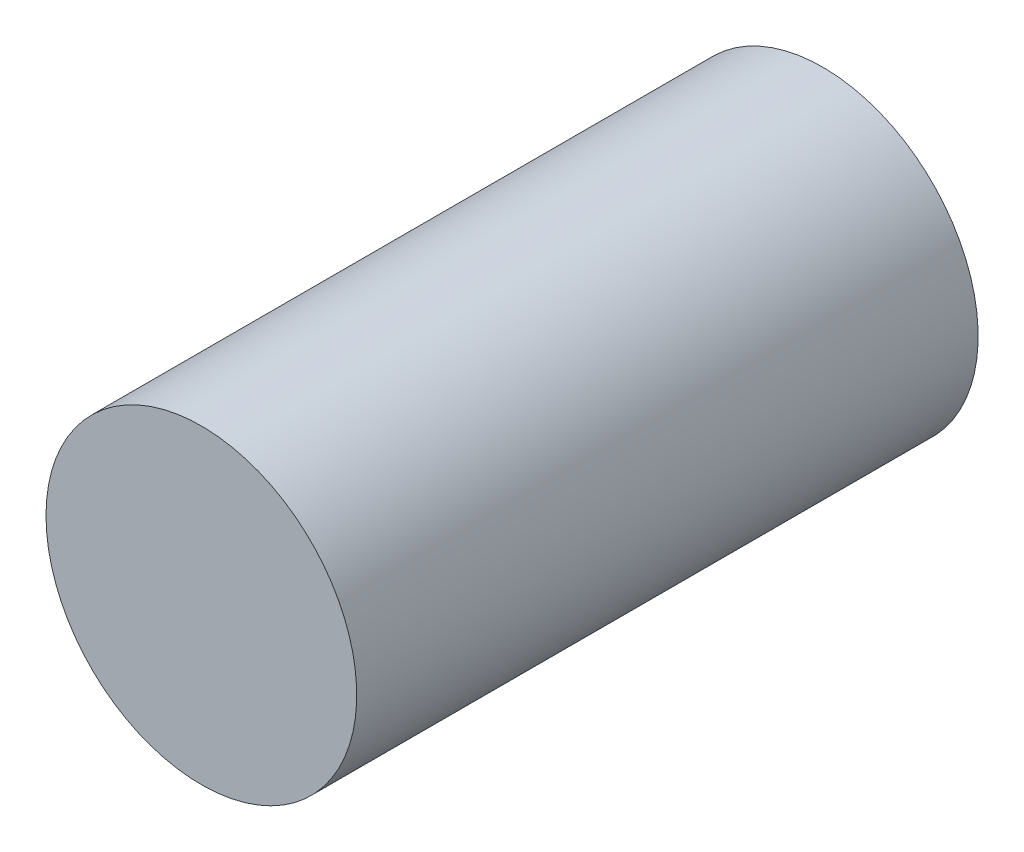
ISO-10303-21;
HEADER;
FILE_DESCRIPTION(('STEP AP214'),'2;1');
FILE_NAME('part.step','',(''),(''),'','','');
FILE_SCHEMA(('AUTOMOTIVE_DESIGN { 1 0 10303 214 1 1 1 1 }'));
ENDSEC;
DATA;
#1=APPLICATION_CONTEXT('core data for automotive mechanical design processes');
#2=APPLICATION_PROTOCOL_DEFINITION('international standard','automotive_design',2000,#1);
#3=PRODUCT_CONTEXT('',#1,'mechanical');
#4=PRODUCT('Part','Part','',(#3));
#5=PRODUCT_RELATED_PRODUCT_CATEGORY('part','',(#4));
#6=PRODUCT_DEFINITION_FORMATION('','',#4);
#7=PRODUCT_DEFINITION_CONTEXT('part definition',#1,'design');
#8=PRODUCT_DEFINITION('design','',#6,#7);
#9=PRODUCT_DEFINITION_SHAPE('','',#8);
#10=(LENGTH_UNIT() NAMED_UNIT(*) SI_UNIT(.MILLI.,.METRE.));
#11=(NAMED_UNIT(*) PLANE_ANGLE_UNIT() SI_UNIT($,.RADIAN.));
#12=(NAMED_UNIT(*) SI_UNIT($,.STERADIAN.) SOLID_ANGLE_UNIT());
#13=UNCERTAINTY_MEASURE_WITH_UNIT(LENGTH_MEASURE(1.E-05),#10,'distance_accuracy_value','');
#14=(GEOMETRIC_REPRESENTATION_CONTEXT(3) GLOBAL_UNCERTAINTY_ASSIGNED_CONTEXT((#13)) GLOBAL_UNIT_ASSIGNED_CONTEXT((#10,
#11,#12)) REPRESENTATION_CONTEXT('',''));
#15=CARTESIAN_POINT('',(0.,0.,0.));
#16=DIRECTION('',(0.,0.,1.));
#17=DIRECTION('',(1.,0.,0.));
#18=AXIS2_PLACEMENT_3D('',#15,#16,#17);
#19=CARTESIAN_POINT('',(1.27,0.,0.));
#20=DIRECTION('',(0.,0.,-1.));
#21=DIRECTION('',(-1.,0.,0.));
#22=AXIS2_PLACEMENT_3D('',#19,#20,#21);
#23=PLANE('',#22);
#24=CARTESIAN_POINT('',(0.,0.,0.));
#25=DIRECTION('',(0.,0.,-1.));
#26=DIRECTION('',(-1.,0.,0.));
#27=AXIS2_PLACEMENT_3D('',#24,#25,#26);
#28=CIRCLE('',#27,1.27);
#29=CARTESIAN_POINT('',(-1.27,0.,0.));
#30=VERTEX_POINT('',#29);
#31=EDGE_CURVE('E18',#30,#30,#28,.F.);
#32=ORIENTED_EDGE('',*,*,#31,.F.);
#33=EDGE_LOOP('',(#32));
#34=FACE_BOUND('',#33,.T.);
#35=ADVANCED_FACE('F15',(#34),#23,.T.);
#36=CARTESIAN_POINT('',(1.27,0.,5.08));
#37=DIRECTION('',(0.,0.,-1.));
#38=DIRECTION('',(-1.,0.,0.));
#39=AXIS2_PLACEMENT_3D('',#36,#37,#38);
#40=PLANE('',#39);
#41=CARTESIAN_POINT('',(0.,0.,5.08));
#42=DIRECTION('',(0.,0.,-1.));
#43=DIRECTION('',(-1.,0.,0.));
#44=AXIS2_PLACEMENT_3D('',#41,#42,#43);
#45=CIRCLE('',#44,1.27);
#46=CARTESIAN_POINT('',(-1.27,0.,5.08));
#47=VERTEX_POINT('',#46);
#48=EDGE_CURVE('E10',#47,#47,#45,.T.);
#49=ORIENTED_EDGE('',*,*,#48,.F.);
#50=EDGE_LOOP('',(#49));
#51=FACE_BOUND('',#50,.T.);
#52=ADVANCED_FACE('F30',(#51),#40,.F.);
#53=CARTESIAN_POINT('',(0.,0.,0.));
#54=DIRECTION('',(0.,0.,-1.));
#55=DIRECTION('',(-1.,0.,0.));
#56=AXIS2_PLACEMENT_3D('',#53,#54,#55);
#57=CYLINDRICAL_SURFACE('',#56,1.27);
#58=ORIENTED_EDGE('',*,*,#31,.T.);
#59=EDGE_LOOP('',(#58));
#60=FACE_BOUND('',#59,.T.);
#61=ORIENTED_EDGE('',*,*,#48,.T.);
#62=EDGE_LOOP('',(#61));
#63=FACE_BOUND('',#62,.T.);
#64=ADVANCED_FACE('F27',(#60,#63),#57,.T.);
#65=CLOSED_SHELL('',(#35,#52,#64));
#66=MANIFOLD_SOLID_BREP('B1',#65);
#67=ADVANCED_BREP_SHAPE_REPRESENTATION('',(#18,#66),#14);
#68=SHAPE_DEFINITION_REPRESENTATION(#9,#67);
ENDSEC;
END-ISO-10303-21;
